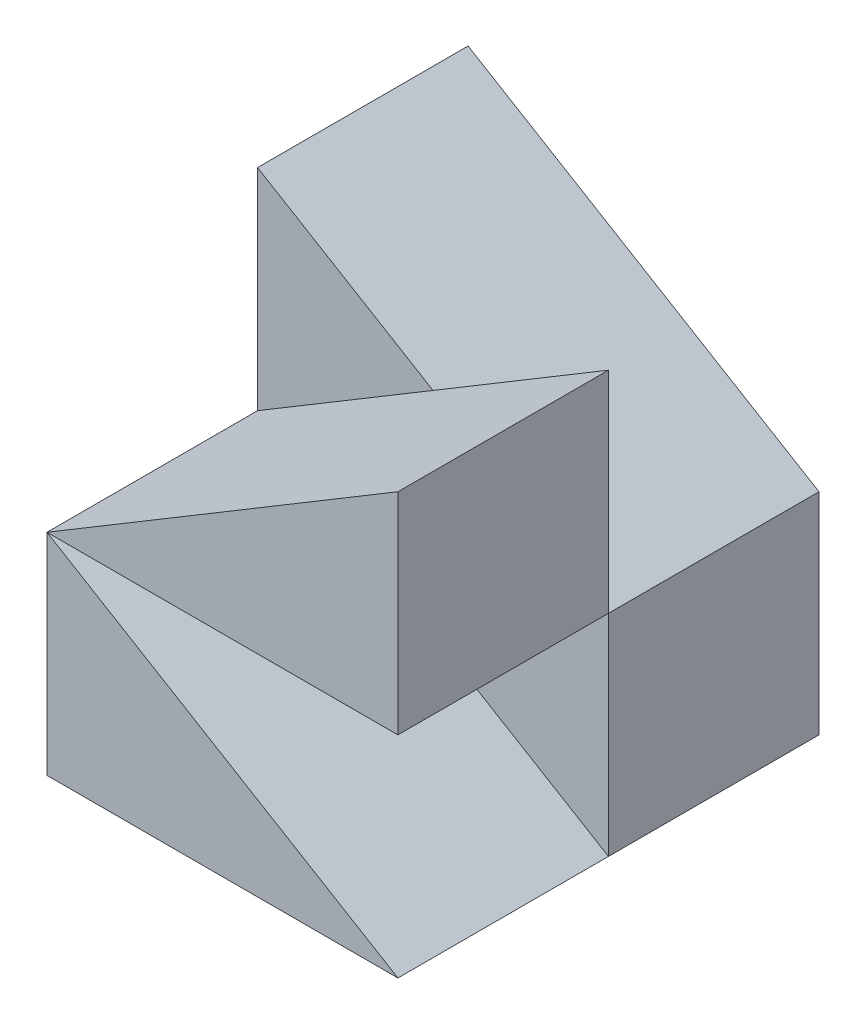
ISO-10303-21;
HEADER;
FILE_DESCRIPTION(('STEP AP214'),'2;1');
FILE_NAME('part.step','',(''),(''),'','','');
FILE_SCHEMA(('AUTOMOTIVE_DESIGN { 1 0 10303 214 1 1 1 1 }'));
ENDSEC;
DATA;
#1=APPLICATION_CONTEXT('core data for automotive mechanical design processes');
#2=APPLICATION_PROTOCOL_DEFINITION('international standard','automotive_design',2000,#1);
#3=PRODUCT_CONTEXT('',#1,'mechanical');
#4=PRODUCT('Part','Part','',(#3));
#5=PRODUCT_RELATED_PRODUCT_CATEGORY('part','',(#4));
#6=PRODUCT_DEFINITION_FORMATION('','',#4);
#7=PRODUCT_DEFINITION_CONTEXT('part definition',#1,'design');
#8=PRODUCT_DEFINITION('design','',#6,#7);
#9=PRODUCT_DEFINITION_SHAPE('','',#8);
#10=(LENGTH_UNIT() NAMED_UNIT(*) SI_UNIT(.MILLI.,.METRE.));
#11=(NAMED_UNIT(*) PLANE_ANGLE_UNIT() SI_UNIT($,.RADIAN.));
#12=(NAMED_UNIT(*) SI_UNIT($,.STERADIAN.) SOLID_ANGLE_UNIT());
#13=UNCERTAINTY_MEASURE_WITH_UNIT(LENGTH_MEASURE(1.E-05),#10,'distance_accuracy_value','');
#14=(GEOMETRIC_REPRESENTATION_CONTEXT(3) GLOBAL_UNCERTAINTY_ASSIGNED_CONTEXT((#13)) GLOBAL_UNIT_ASSIGNED_CONTEXT((#10,
#11,#12)) REPRESENTATION_CONTEXT('',''));
#15=CARTESIAN_POINT('',(0.,0.,0.));
#16=DIRECTION('',(0.,0.,1.));
#17=DIRECTION('',(1.,0.,0.));
#18=AXIS2_PLACEMENT_3D('',#15,#16,#17);
#19=CARTESIAN_POINT('',(-25.0004686590648,30.,15.));
#20=DIRECTION('',(0.514488663651815,0.857497180738088,0.));
#21=DIRECTION('',(-0.857497180738088,0.514488663651815,0.));
#22=AXIS2_PLACEMENT_3D('',#19,#20,#21);
#23=PLANE('',#22);
#24=DIRECTION('',(0.857497180738088,-0.514488663651815,0.));
#25=VECTOR('',#24,1.);
#26=CARTESIAN_POINT('',(-25.0004686590648,30.,0.));
#27=LINE('',#26,#25);
#28=CARTESIAN_POINT('',(-25.0004686590648,30.,0.));
#29=VERTEX_POINT('',#28);
#30=CARTESIAN_POINT('',(0.,15.,0.));
#31=VERTEX_POINT('',#30);
#32=EDGE_CURVE('E113',#29,#31,#27,.T.);
#33=ORIENTED_EDGE('',*,*,#32,.F.);
#34=DIRECTION('',(0.,0.,-1.));
#35=VECTOR('',#34,1.);
#36=CARTESIAN_POINT('',(-25.0004686590648,30.,15.));
#37=LINE('',#36,#35);
#38=CARTESIAN_POINT('',(-25.0004686590648,30.,15.));
#39=VERTEX_POINT('',#38);
#40=EDGE_CURVE('E51',#39,#29,#37,.T.);
#41=ORIENTED_EDGE('',*,*,#40,.F.);
#42=DIRECTION('',(0.857497180738088,-0.514488663651815,0.));
#43=VECTOR('',#42,1.);
#44=CARTESIAN_POINT('',(-25.0004686590648,30.,15.));
#45=LINE('',#44,#43);
#46=CARTESIAN_POINT('',(-12.5002343295324,22.5,15.));
#47=VERTEX_POINT('',#46);
#48=EDGE_CURVE('E135',#39,#47,#45,.T.);
#49=ORIENTED_EDGE('',*,*,#48,.T.);
#50=CARTESIAN_POINT('',(0.,15.,15.));
#51=VERTEX_POINT('',#50);
#52=EDGE_CURVE('E137',#47,#51,#45,.T.);
#53=ORIENTED_EDGE('',*,*,#52,.T.);
#54=DIRECTION('',(0.,0.,-1.));
#55=VECTOR('',#54,1.);
#56=CARTESIAN_POINT('',(0.,15.,15.));
#57=LINE('',#56,#55);
#58=EDGE_CURVE('E122',#51,#31,#57,.T.);
#59=ORIENTED_EDGE('',*,*,#58,.T.);
#60=EDGE_LOOP('',(#33,#41,#49,#53,#59));
#61=FACE_BOUND('',#60,.T.);
#62=ADVANCED_FACE('F43',(#61),#23,.T.);
#63=CARTESIAN_POINT('',(-25.0004686590648,15.,15.));
#64=DIRECTION('',(-1.,0.,0.));
#65=DIRECTION('',(0.,0.,1.));
#66=AXIS2_PLACEMENT_3D('',#63,#64,#65);
#67=PLANE('',#66);
#68=DIRECTION('',(0.,1.,0.));
#69=VECTOR('',#68,1.);
#70=CARTESIAN_POINT('',(-25.0004686590648,15.,0.));
#71=LINE('',#70,#69);
#72=CARTESIAN_POINT('',(-25.0004686590648,15.,0.));
#73=VERTEX_POINT('',#72);
#74=EDGE_CURVE('E141',#73,#29,#71,.T.);
#75=ORIENTED_EDGE('',*,*,#74,.F.);
#76=DIRECTION('',(0.,0.,-1.));
#77=VECTOR('',#76,1.);
#78=CARTESIAN_POINT('',(-25.0004686590648,15.,15.));
#79=LINE('',#78,#77);
#80=CARTESIAN_POINT('',(-25.0002343295324,15.,15.));
#81=VERTEX_POINT('',#80);
#82=EDGE_CURVE('E127',#81,#73,#79,.T.);
#83=ORIENTED_EDGE('',*,*,#82,.F.);
#84=DIRECTION('',(0.,1.,0.));
#85=VECTOR('',#84,1.);
#86=CARTESIAN_POINT('',(-25.0004686590648,15.,15.));
#87=LINE('',#86,#85);
#88=EDGE_CURVE('E136',#81,#39,#87,.T.);
#89=ORIENTED_EDGE('',*,*,#88,.T.);
#90=ORIENTED_EDGE('',*,*,#40,.T.);
#91=EDGE_LOOP('',(#75,#83,#89,#90));
#92=FACE_BOUND('',#91,.T.);
#93=ADVANCED_FACE('F149',(#92),#67,.T.);
#94=CARTESIAN_POINT('',(0.,15.,15.));
#95=DIRECTION('',(0.,-1.,0.));
#96=DIRECTION('',(0.,0.,-1.));
#97=AXIS2_PLACEMENT_3D('',#94,#95,#96);
#98=PLANE('',#97);
#99=DIRECTION('',(-1.,0.,0.));
#100=VECTOR('',#99,1.);
#101=CARTESIAN_POINT('',(0.,15.,0.));
#102=LINE('',#101,#100);
#103=EDGE_CURVE('E116',#31,#73,#102,.T.);
#104=ORIENTED_EDGE('',*,*,#103,.F.);
#105=ORIENTED_EDGE('',*,*,#58,.F.);
#106=DIRECTION('',(0.,0.,-1.));
#107=VECTOR('',#106,1.);
#108=CARTESIAN_POINT('',(0.,15.,30.));
#109=LINE('',#108,#107);
#110=CARTESIAN_POINT('',(0.,15.,30.));
#111=VERTEX_POINT('',#110);
#112=EDGE_CURVE('E97',#111,#51,#109,.T.);
#113=ORIENTED_EDGE('',*,*,#112,.F.);
#114=DIRECTION('',(1.,0.,0.));
#115=VECTOR('',#114,1.);
#116=CARTESIAN_POINT('',(-25.0004686590648,15.,30.));
#117=LINE('',#116,#115);
#118=CARTESIAN_POINT('',(-25.0004686590648,15.,30.));
#119=VERTEX_POINT('',#118);
#120=EDGE_CURVE('E91',#119,#111,#117,.T.);
#121=ORIENTED_EDGE('',*,*,#120,.F.);
#122=DIRECTION('',(0.,0.,-1.));
#123=VECTOR('',#122,1.);
#124=CARTESIAN_POINT('',(-25.0004686590648,15.,30.));
#125=LINE('',#124,#123);
#126=EDGE_CURVE('E59',#119,#81,#125,.T.);
#127=ORIENTED_EDGE('',*,*,#126,.T.);
#128=ORIENTED_EDGE('',*,*,#82,.T.);
#129=EDGE_LOOP('',(#104,#105,#113,#121,#127,#128));
#130=FACE_BOUND('',#129,.T.);
#131=ADVANCED_FACE('F94',(#130),#98,.T.);
#132=CARTESIAN_POINT('',(0.,0.,15.));
#133=DIRECTION('',(0.,0.,1.));
#134=DIRECTION('',(1.,0.,0.));
#135=AXIS2_PLACEMENT_3D('',#132,#133,#134);
#136=PLANE('',#135);
#137=DIRECTION('',(-0.857497180738088,-0.514488663651815,0.));
#138=VECTOR('',#137,1.);
#139=CARTESIAN_POINT('',(0.,30.,15.));
#140=LINE('',#139,#138);
#141=EDGE_CURVE('E12',#47,#81,#140,.T.);
#142=ORIENTED_EDGE('',*,*,#141,.F.);
#143=ORIENTED_EDGE('',*,*,#48,.F.);
#144=ORIENTED_EDGE('',*,*,#88,.F.);
#145=EDGE_LOOP('',(#142,#143,#144));
#146=FACE_BOUND('',#145,.T.);
#147=ADVANCED_FACE('F150',(#146),#136,.T.);
#148=CARTESIAN_POINT('',(0.,0.,0.));
#149=DIRECTION('',(0.,0.,1.));
#150=DIRECTION('',(1.,0.,0.));
#151=AXIS2_PLACEMENT_3D('',#148,#149,#150);
#152=PLANE('',#151);
#153=ORIENTED_EDGE('',*,*,#32,.T.);
#154=ORIENTED_EDGE('',*,*,#103,.T.);
#155=ORIENTED_EDGE('',*,*,#74,.T.);
#156=EDGE_LOOP('',(#153,#154,#155));
#157=FACE_BOUND('',#156,.T.);
#158=ADVANCED_FACE('F176',(#157),#152,.F.);
#159=CARTESIAN_POINT('',(0.,0.,15.));
#160=DIRECTION('',(0.,0.,-1.));
#161=DIRECTION('',(-1.,0.,0.));
#162=AXIS2_PLACEMENT_3D('',#159,#160,#161);
#163=PLANE('',#162);
#164=ORIENTED_EDGE('',*,*,#52,.F.);
#165=CARTESIAN_POINT('',(0.,30.,15.));
#166=VERTEX_POINT('',#165);
#167=EDGE_CURVE('E129',#166,#47,#140,.T.);
#168=ORIENTED_EDGE('',*,*,#167,.F.);
#169=DIRECTION('',(0.,1.,0.));
#170=VECTOR('',#169,1.);
#171=CARTESIAN_POINT('',(0.,15.,15.));
#172=LINE('',#171,#170);
#173=EDGE_CURVE('E108',#51,#166,#172,.T.);
#174=ORIENTED_EDGE('',*,*,#173,.F.);
#175=EDGE_LOOP('',(#164,#168,#174));
#176=FACE_BOUND('',#175,.T.);
#177=ADVANCED_FACE('F155',(#176),#163,.T.);
#178=CARTESIAN_POINT('',(0.,30.,30.));
#179=DIRECTION('',(0.514488663651815,-0.857497180738088,0.));
#180=DIRECTION('',(0.857497180738088,0.514488663651815,0.));
#181=AXIS2_PLACEMENT_3D('',#178,#179,#180);
#182=PLANE('',#181);
#183=ORIENTED_EDGE('',*,*,#167,.T.);
#184=ORIENTED_EDGE('',*,*,#141,.T.);
#185=ORIENTED_EDGE('',*,*,#126,.F.);
#186=DIRECTION('',(-0.857497180738088,-0.514488663651815,0.));
#187=VECTOR('',#186,1.);
#188=CARTESIAN_POINT('',(0.,30.,30.));
#189=LINE('',#188,#187);
#190=CARTESIAN_POINT('',(0.,30.,30.));
#191=VERTEX_POINT('',#190);
#192=EDGE_CURVE('E101',#191,#119,#189,.T.);
#193=ORIENTED_EDGE('',*,*,#192,.F.);
#194=DIRECTION('',(0.,0.,-1.));
#195=VECTOR('',#194,1.);
#196=CARTESIAN_POINT('',(0.,30.,30.));
#197=LINE('',#196,#195);
#198=EDGE_CURVE('E118',#191,#166,#197,.T.);
#199=ORIENTED_EDGE('',*,*,#198,.T.);
#200=EDGE_LOOP('',(#183,#184,#185,#193,#199));
#201=FACE_BOUND('',#200,.T.);
#202=ADVANCED_FACE('F111',(#201),#182,.F.);
#203=CARTESIAN_POINT('',(0.,15.,30.));
#204=DIRECTION('',(-1.,0.,0.));
#205=DIRECTION('',(0.,-1.,0.));
#206=AXIS2_PLACEMENT_3D('',#203,#204,#205);
#207=PLANE('',#206);
#208=ORIENTED_EDGE('',*,*,#173,.T.);
#209=ORIENTED_EDGE('',*,*,#198,.F.);
#210=DIRECTION('',(0.,1.,0.));
#211=VECTOR('',#210,1.);
#212=CARTESIAN_POINT('',(0.,15.,30.));
#213=LINE('',#212,#211);
#214=EDGE_CURVE('E100',#111,#191,#213,.T.);
#215=ORIENTED_EDGE('',*,*,#214,.F.);
#216=ORIENTED_EDGE('',*,*,#112,.T.);
#217=EDGE_LOOP('',(#208,#209,#215,#216));
#218=FACE_BOUND('',#217,.T.);
#219=ADVANCED_FACE('F157',(#218),#207,.F.);
#220=CARTESIAN_POINT('',(0.,0.,30.));
#221=DIRECTION('',(0.,0.,-1.));
#222=DIRECTION('',(-1.,0.,0.));
#223=AXIS2_PLACEMENT_3D('',#220,#221,#222);
#224=PLANE('',#223);
#225=ORIENTED_EDGE('',*,*,#192,.T.);
#226=ORIENTED_EDGE('',*,*,#120,.T.);
#227=ORIENTED_EDGE('',*,*,#214,.T.);
#228=EDGE_LOOP('',(#225,#226,#227));
#229=FACE_BOUND('',#228,.T.);
#230=ADVANCED_FACE('F104',(#229),#224,.F.);
#231=CLOSED_SHELL('',(#62,#93,#131,#147,#158,#177,#202,#219,#230));
#232=MANIFOLD_SOLID_BREP('B2',#231);
#233=CARTESIAN_POINT('',(0.,0.,15.));
#234=DIRECTION('',(0.,1.,0.));
#235=DIRECTION('',(-1.,0.,0.));
#236=AXIS2_PLACEMENT_3D('',#233,#234,#235);
#237=PLANE('',#236);
#238=DIRECTION('',(1.,0.,0.));
#239=VECTOR('',#238,1.);
#240=CARTESIAN_POINT('',(0.,0.,0.));
#241=LINE('',#240,#239);
#242=CARTESIAN_POINT('',(-25.,0.,0.));
#243=VERTEX_POINT('',#242);
#244=CARTESIAN_POINT('',(0.,0.,0.));
#245=VERTEX_POINT('',#244);
#246=EDGE_CURVE('E316',#243,#245,#241,.T.);
#247=ORIENTED_EDGE('',*,*,#246,.T.);
#248=DIRECTION('',(0.,0.,-1.));
#249=VECTOR('',#248,1.);
#250=CARTESIAN_POINT('',(0.,0.,15.));
#251=LINE('',#250,#249);
#252=CARTESIAN_POINT('',(0.,0.,15.));
#253=VERTEX_POINT('',#252);
#254=EDGE_CURVE('E41',#253,#245,#251,.T.);
#255=ORIENTED_EDGE('',*,*,#254,.F.);
#256=DIRECTION('',(0.,0.,-1.));
#257=VECTOR('',#256,1.);
#258=CARTESIAN_POINT('',(0.,0.,30.));
#259=LINE('',#258,#257);
#260=CARTESIAN_POINT('',(0.,0.,30.));
#261=VERTEX_POINT('',#260);
#262=EDGE_CURVE('E320',#261,#253,#259,.T.);
#263=ORIENTED_EDGE('',*,*,#262,.F.);
#264=DIRECTION('',(1.,0.,0.));
#265=VECTOR('',#264,1.);
#266=CARTESIAN_POINT('',(0.,0.,30.));
#267=LINE('',#266,#265);
#268=CARTESIAN_POINT('',(-25.,0.,30.));
#269=VERTEX_POINT('',#268);
#270=EDGE_CURVE('E302',#269,#261,#267,.T.);
#271=ORIENTED_EDGE('',*,*,#270,.F.);
#272=DIRECTION('',(0.,0.,-1.));
#273=VECTOR('',#272,1.);
#274=CARTESIAN_POINT('',(-25.,0.,30.));
#275=LINE('',#274,#273);
#276=CARTESIAN_POINT('',(-25.,0.,15.));
#277=VERTEX_POINT('',#276);
#278=EDGE_CURVE('E299',#269,#277,#275,.T.);
#279=ORIENTED_EDGE('',*,*,#278,.T.);
#280=DIRECTION('',(0.,0.,-1.));
#281=VECTOR('',#280,1.);
#282=CARTESIAN_POINT('',(-25.,0.,15.));
#283=LINE('',#282,#281);
#284=EDGE_CURVE('E252',#277,#243,#283,.T.);
#285=ORIENTED_EDGE('',*,*,#284,.T.);
#286=EDGE_LOOP('',(#247,#255,#263,#271,#279,#285));
#287=FACE_BOUND('',#286,.T.);
#288=ADVANCED_FACE('F236',(#287),#237,.F.);
#289=CARTESIAN_POINT('',(0.,15.,15.));
#290=DIRECTION('',(-1.,0.,0.));
#291=DIRECTION('',(0.,-1.,0.));
#292=AXIS2_PLACEMENT_3D('',#289,#290,#291);
#293=PLANE('',#292);
#294=DIRECTION('',(0.,1.,0.));
#295=VECTOR('',#294,1.);
#296=CARTESIAN_POINT('',(0.,15.,0.));
#297=LINE('',#296,#295);
#298=CARTESIAN_POINT('',(0.,15.,0.));
#299=VERTEX_POINT('',#298);
#300=EDGE_CURVE('E266',#245,#299,#297,.T.);
#301=ORIENTED_EDGE('',*,*,#300,.T.);
#302=DIRECTION('',(0.,0.,-1.));
#303=VECTOR('',#302,1.);
#304=CARTESIAN_POINT('',(0.,15.,15.));
#305=LINE('',#304,#303);
#306=CARTESIAN_POINT('',(0.,15.,15.));
#307=VERTEX_POINT('',#306);
#308=EDGE_CURVE('E244',#307,#299,#305,.T.);
#309=ORIENTED_EDGE('',*,*,#308,.F.);
#310=DIRECTION('',(0.,1.,0.));
#311=VECTOR('',#310,1.);
#312=CARTESIAN_POINT('',(0.,15.,15.));
#313=LINE('',#312,#311);
#314=EDGE_CURVE('E324',#253,#307,#313,.T.);
#315=ORIENTED_EDGE('',*,*,#314,.F.);
#316=ORIENTED_EDGE('',*,*,#254,.T.);
#317=EDGE_LOOP('',(#301,#309,#315,#316));
#318=FACE_BOUND('',#317,.T.);
#319=ADVANCED_FACE('F355',(#318),#293,.F.);
#320=CARTESIAN_POINT('',(-25.,0.,15.));
#321=DIRECTION('',(0.514495755427526,-0.857492925712544,0.));
#322=DIRECTION('',(0.857492925712544,0.514495755427527,0.));
#323=AXIS2_PLACEMENT_3D('',#320,#321,#322);
#324=PLANE('',#323);
#325=DIRECTION('',(-0.857492925712544,-0.514495755427527,0.));
#326=VECTOR('',#325,1.);
#327=CARTESIAN_POINT('',(-25.,0.,0.));
#328=LINE('',#327,#326);
#329=EDGE_CURVE('E269',#299,#243,#328,.T.);
#330=ORIENTED_EDGE('',*,*,#329,.T.);
#331=ORIENTED_EDGE('',*,*,#284,.F.);
#332=DIRECTION('',(-0.857492925712544,-0.514495755427527,0.));
#333=VECTOR('',#332,1.);
#334=CARTESIAN_POINT('',(-25.,0.,15.));
#335=LINE('',#334,#333);
#336=CARTESIAN_POINT('',(-12.5,7.5,15.));
#337=VERTEX_POINT('',#336);
#338=EDGE_CURVE('E326',#337,#277,#335,.T.);
#339=ORIENTED_EDGE('',*,*,#338,.F.);
#340=EDGE_CURVE('E327',#307,#337,#335,.T.);
#341=ORIENTED_EDGE('',*,*,#340,.F.);
#342=ORIENTED_EDGE('',*,*,#308,.T.);
#343=EDGE_LOOP('',(#330,#331,#339,#341,#342));
#344=FACE_BOUND('',#343,.T.);
#345=ADVANCED_FACE('F332',(#344),#324,.F.);
#346=CARTESIAN_POINT('',(0.,0.,15.));
#347=DIRECTION('',(0.,0.,1.));
#348=DIRECTION('',(1.,0.,0.));
#349=AXIS2_PLACEMENT_3D('',#346,#347,#348);
#350=PLANE('',#349);
#351=DIRECTION('',(-0.857492925712544,0.514495755427526,0.));
#352=VECTOR('',#351,1.);
#353=CARTESIAN_POINT('',(-25.,15.,15.));
#354=LINE('',#353,#352);
#355=EDGE_CURVE('E274',#253,#337,#354,.T.);
#356=ORIENTED_EDGE('',*,*,#355,.F.);
#357=ORIENTED_EDGE('',*,*,#314,.T.);
#358=ORIENTED_EDGE('',*,*,#340,.T.);
#359=EDGE_LOOP('',(#356,#357,#358));
#360=FACE_BOUND('',#359,.T.);
#361=ADVANCED_FACE('F350',(#360),#350,.T.);
#362=CARTESIAN_POINT('',(0.,0.,0.));
#363=DIRECTION('',(0.,0.,1.));
#364=DIRECTION('',(1.,0.,0.));
#365=AXIS2_PLACEMENT_3D('',#362,#363,#364);
#366=PLANE('',#365);
#367=ORIENTED_EDGE('',*,*,#246,.F.);
#368=ORIENTED_EDGE('',*,*,#329,.F.);
#369=ORIENTED_EDGE('',*,*,#300,.F.);
#370=EDGE_LOOP('',(#367,#368,#369));
#371=FACE_BOUND('',#370,.T.);
#372=ADVANCED_FACE('F335',(#371),#366,.F.);
#373=CARTESIAN_POINT('',(0.,0.,15.));
#374=DIRECTION('',(0.,0.,1.));
#375=DIRECTION('',(1.,0.,0.));
#376=AXIS2_PLACEMENT_3D('',#373,#374,#375);
#377=PLANE('',#376);
#378=CARTESIAN_POINT('',(-25.,15.,15.));
#379=VERTEX_POINT('',#378);
#380=EDGE_CURVE('E314',#337,#379,#354,.T.);
#381=ORIENTED_EDGE('',*,*,#380,.F.);
#382=ORIENTED_EDGE('',*,*,#338,.T.);
#383=DIRECTION('',(0.,-1.,0.));
#384=VECTOR('',#383,1.);
#385=CARTESIAN_POINT('',(-25.,0.,15.));
#386=LINE('',#385,#384);
#387=EDGE_CURVE('E310',#379,#277,#386,.T.);
#388=ORIENTED_EDGE('',*,*,#387,.F.);
#389=EDGE_LOOP('',(#381,#382,#388));
#390=FACE_BOUND('',#389,.T.);
#391=ADVANCED_FACE('F342',(#390),#377,.F.);
#392=CARTESIAN_POINT('',(-25.,15.,30.));
#393=DIRECTION('',(-0.514495755427526,-0.857492925712544,0.));
#394=DIRECTION('',(0.857492925712544,-0.514495755427526,0.));
#395=AXIS2_PLACEMENT_3D('',#392,#393,#394);
#396=PLANE('',#395);
#397=ORIENTED_EDGE('',*,*,#355,.T.);
#398=ORIENTED_EDGE('',*,*,#380,.T.);
#399=DIRECTION('',(0.,0.,-1.));
#400=VECTOR('',#399,1.);
#401=CARTESIAN_POINT('',(-25.,15.,30.));
#402=LINE('',#401,#400);
#403=CARTESIAN_POINT('',(-25.,15.,30.));
#404=VERTEX_POINT('',#403);
#405=EDGE_CURVE('E297',#404,#379,#402,.T.);
#406=ORIENTED_EDGE('',*,*,#405,.F.);
#407=DIRECTION('',(-0.857492925712544,0.514495755427526,0.));
#408=VECTOR('',#407,1.);
#409=CARTESIAN_POINT('',(-25.,15.,30.));
#410=LINE('',#409,#408);
#411=EDGE_CURVE('E303',#261,#404,#410,.T.);
#412=ORIENTED_EDGE('',*,*,#411,.F.);
#413=ORIENTED_EDGE('',*,*,#262,.T.);
#414=EDGE_LOOP('',(#397,#398,#406,#412,#413));
#415=FACE_BOUND('',#414,.T.);
#416=ADVANCED_FACE('F312',(#415),#396,.F.);
#417=CARTESIAN_POINT('',(-25.,0.,30.));
#418=DIRECTION('',(1.,0.,0.));
#419=DIRECTION('',(0.,0.,-1.));
#420=AXIS2_PLACEMENT_3D('',#417,#418,#419);
#421=PLANE('',#420);
#422=ORIENTED_EDGE('',*,*,#387,.T.);
#423=ORIENTED_EDGE('',*,*,#278,.F.);
#424=DIRECTION('',(0.,-1.,0.));
#425=VECTOR('',#424,1.);
#426=CARTESIAN_POINT('',(-25.,0.,30.));
#427=LINE('',#426,#425);
#428=EDGE_CURVE('E292',#404,#269,#427,.T.);
#429=ORIENTED_EDGE('',*,*,#428,.F.);
#430=ORIENTED_EDGE('',*,*,#405,.T.);
#431=EDGE_LOOP('',(#422,#423,#429,#430));
#432=FACE_BOUND('',#431,.T.);
#433=ADVANCED_FACE('F295',(#432),#421,.F.);
#434=CARTESIAN_POINT('',(0.,0.,30.));
#435=DIRECTION('',(0.,0.,1.));
#436=DIRECTION('',(1.,0.,0.));
#437=AXIS2_PLACEMENT_3D('',#434,#435,#436);
#438=PLANE('',#437);
#439=ORIENTED_EDGE('',*,*,#411,.T.);
#440=ORIENTED_EDGE('',*,*,#428,.T.);
#441=ORIENTED_EDGE('',*,*,#270,.T.);
#442=EDGE_LOOP('',(#439,#440,#441));
#443=FACE_BOUND('',#442,.T.);
#444=ADVANCED_FACE('F306',(#443),#438,.T.);
#445=CLOSED_SHELL('',(#288,#319,#345,#361,#372,#391,#416,#433,#444));
#446=MANIFOLD_SOLID_BREP('B6',#445);
#447=ADVANCED_BREP_SHAPE_REPRESENTATION('',(#18,#232,#446),#14);
#448=SHAPE_DEFINITION_REPRESENTATION(#9,#447);
ENDSEC;
END-ISO-10303-21;
